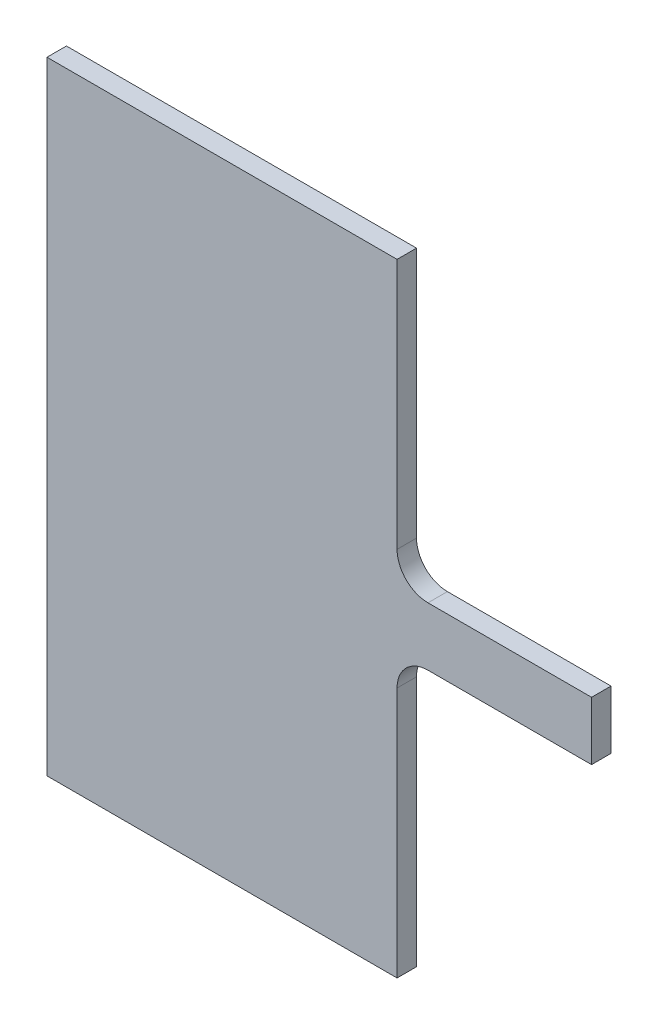
ISO-10303-21;
HEADER;
FILE_DESCRIPTION(('STEP AP214'),'2;1');
FILE_NAME('part.step','',(''),(''),'','','');
FILE_SCHEMA(('AUTOMOTIVE_DESIGN { 1 0 10303 214 1 1 1 1 }'));
ENDSEC;
DATA;
#1=APPLICATION_CONTEXT('core data for automotive mechanical design processes');
#2=APPLICATION_PROTOCOL_DEFINITION('international standard','automotive_design',2000,#1);
#3=PRODUCT_CONTEXT('',#1,'mechanical');
#4=PRODUCT('Part','Part','',(#3));
#5=PRODUCT_RELATED_PRODUCT_CATEGORY('part','',(#4));
#6=PRODUCT_DEFINITION_FORMATION('','',#4);
#7=PRODUCT_DEFINITION_CONTEXT('part definition',#1,'design');
#8=PRODUCT_DEFINITION('design','',#6,#7);
#9=PRODUCT_DEFINITION_SHAPE('','',#8);
#10=(LENGTH_UNIT() NAMED_UNIT(*) SI_UNIT(.MILLI.,.METRE.));
#11=(NAMED_UNIT(*) PLANE_ANGLE_UNIT() SI_UNIT($,.RADIAN.));
#12=(NAMED_UNIT(*) SI_UNIT($,.STERADIAN.) SOLID_ANGLE_UNIT());
#13=UNCERTAINTY_MEASURE_WITH_UNIT(LENGTH_MEASURE(1.E-05),#10,'distance_accuracy_value','');
#14=(GEOMETRIC_REPRESENTATION_CONTEXT(3) GLOBAL_UNCERTAINTY_ASSIGNED_CONTEXT((#13)) GLOBAL_UNIT_ASSIGNED_CONTEXT((#10,
#11,#12)) REPRESENTATION_CONTEXT('',''));
#15=CARTESIAN_POINT('',(0.,0.,0.));
#16=DIRECTION('',(0.,0.,1.));
#17=DIRECTION('',(1.,0.,0.));
#18=AXIS2_PLACEMENT_3D('',#15,#16,#17);
#19=CARTESIAN_POINT('',(11.7362926460684,-7.00000000000002,1.));
#20=DIRECTION('',(1.,0.,0.));
#21=DIRECTION('',(0.,0.,-1.));
#22=AXIS2_PLACEMENT_3D('',#19,#20,#21);
#23=PLANE('',#22);
#24=DIRECTION('',(0.,-1.,0.));
#25=VECTOR('',#24,1.);
#26=CARTESIAN_POINT('',(11.7362926460684,-7.00000000000002,0.));
#27=LINE('',#26,#25);
#28=CARTESIAN_POINT('',(11.7362926460684,25.,0.));
#29=VERTEX_POINT('',#28);
#30=CARTESIAN_POINT('',(11.7362926460684,-7.00000000000002,0.));
#31=VERTEX_POINT('',#30);
#32=EDGE_CURVE('E153',#29,#31,#27,.T.);
#33=ORIENTED_EDGE('',*,*,#32,.T.);
#34=DIRECTION('',(0.,0.,-1.));
#35=VECTOR('',#34,1.);
#36=CARTESIAN_POINT('',(11.7362926460684,-7.00000000000002,1.));
#37=LINE('',#36,#35);
#38=CARTESIAN_POINT('',(11.7362926460684,-7.00000000000002,1.));
#39=VERTEX_POINT('',#38);
#40=EDGE_CURVE('E11',#39,#31,#37,.T.);
#41=ORIENTED_EDGE('',*,*,#40,.F.);
#42=DIRECTION('',(0.,-1.,0.));
#43=VECTOR('',#42,1.);
#44=CARTESIAN_POINT('',(11.7362926460684,-7.00000000000002,1.));
#45=LINE('',#44,#43);
#46=CARTESIAN_POINT('',(11.7362926460684,25.,1.));
#47=VERTEX_POINT('',#46);
#48=EDGE_CURVE('E180',#47,#39,#45,.T.);
#49=ORIENTED_EDGE('',*,*,#48,.F.);
#50=DIRECTION('',(0.,0.,-1.));
#51=VECTOR('',#50,1.);
#52=CARTESIAN_POINT('',(11.7362926460684,25.,1.));
#53=LINE('',#52,#51);
#54=EDGE_CURVE('E149',#47,#29,#53,.T.);
#55=ORIENTED_EDGE('',*,*,#54,.T.);
#56=EDGE_LOOP('',(#33,#41,#49,#55));
#57=FACE_BOUND('',#56,.T.);
#58=ADVANCED_FACE('F38',(#57),#23,.F.);
#59=CARTESIAN_POINT('',(29.7362926460684,-7.00000000000002,1.));
#60=DIRECTION('',(0.,1.,0.));
#61=DIRECTION('',(-1.,0.,0.));
#62=AXIS2_PLACEMENT_3D('',#59,#60,#61);
#63=PLANE('',#62);
#64=DIRECTION('',(1.,0.,0.));
#65=VECTOR('',#64,1.);
#66=CARTESIAN_POINT('',(29.7362926460684,-7.00000000000002,0.));
#67=LINE('',#66,#65);
#68=CARTESIAN_POINT('',(29.7362926460684,-7.00000000000002,0.));
#69=VERTEX_POINT('',#68);
#70=EDGE_CURVE('E157',#31,#69,#67,.T.);
#71=ORIENTED_EDGE('',*,*,#70,.T.);
#72=DIRECTION('',(0.,0.,-1.));
#73=VECTOR('',#72,1.);
#74=CARTESIAN_POINT('',(29.7362926460684,-7.00000000000002,1.));
#75=LINE('',#74,#73);
#76=CARTESIAN_POINT('',(29.7362926460684,-7.00000000000002,1.));
#77=VERTEX_POINT('',#76);
#78=EDGE_CURVE('E47',#77,#69,#75,.T.);
#79=ORIENTED_EDGE('',*,*,#78,.F.);
#80=DIRECTION('',(1.,0.,0.));
#81=VECTOR('',#80,1.);
#82=CARTESIAN_POINT('',(29.7362926460684,-7.00000000000002,1.));
#83=LINE('',#82,#81);
#84=EDGE_CURVE('E104',#39,#77,#83,.T.);
#85=ORIENTED_EDGE('',*,*,#84,.F.);
#86=ORIENTED_EDGE('',*,*,#40,.T.);
#87=EDGE_LOOP('',(#71,#79,#85,#86));
#88=FACE_BOUND('',#87,.T.);
#89=ADVANCED_FACE('F243',(#88),#63,.F.);
#90=CARTESIAN_POINT('',(29.7362926460684,-7.00000000000002,1.));
#91=DIRECTION('',(-1.,0.,0.));
#92=DIRECTION('',(0.,0.,1.));
#93=AXIS2_PLACEMENT_3D('',#90,#91,#92);
#94=PLANE('',#93);
#95=DIRECTION('',(0.,1.,0.));
#96=VECTOR('',#95,1.);
#97=CARTESIAN_POINT('',(29.7362926460684,-7.00000000000002,0.));
#98=LINE('',#97,#96);
#99=CARTESIAN_POINT('',(29.7362926460684,5.91249999999997,0.));
#100=VERTEX_POINT('',#99);
#101=EDGE_CURVE('E160',#69,#100,#98,.T.);
#102=ORIENTED_EDGE('',*,*,#101,.T.);
#103=DIRECTION('',(0.,0.,-1.));
#104=VECTOR('',#103,1.);
#105=CARTESIAN_POINT('',(29.7362926460684,5.91249999999997,1.));
#106=LINE('',#105,#104);
#107=CARTESIAN_POINT('',(29.7362926460684,5.91249999999997,1.));
#108=VERTEX_POINT('',#107);
#109=EDGE_CURVE('E199',#108,#100,#106,.T.);
#110=ORIENTED_EDGE('',*,*,#109,.F.);
#111=DIRECTION('',(0.,1.,0.));
#112=VECTOR('',#111,1.);
#113=CARTESIAN_POINT('',(29.7362926460684,-7.00000000000002,1.));
#114=LINE('',#113,#112);
#115=EDGE_CURVE('E209',#77,#108,#114,.T.);
#116=ORIENTED_EDGE('',*,*,#115,.F.);
#117=ORIENTED_EDGE('',*,*,#78,.T.);
#118=EDGE_LOOP('',(#102,#110,#116,#117));
#119=FACE_BOUND('',#118,.T.);
#120=ADVANCED_FACE('F207',(#119),#94,.F.);
#121=CARTESIAN_POINT('',(31.3237926460684,5.91249999999998,1.));
#122=DIRECTION('',(0.,0.,-1.));
#123=DIRECTION('',(-1.,0.,0.));
#124=AXIS2_PLACEMENT_3D('',#121,#122,#123);
#125=CYLINDRICAL_SURFACE('',#124,1.5875);
#126=CARTESIAN_POINT('',(31.3237926460684,5.91249999999998,0.));
#127=DIRECTION('',(0.,0.,-1.));
#128=DIRECTION('',(1.,0.,0.));
#129=AXIS2_PLACEMENT_3D('',#126,#127,#128);
#130=CIRCLE('',#129,1.5875);
#131=CARTESIAN_POINT('',(31.3237926460684,7.49999999999998,0.));
#132=VERTEX_POINT('',#131);
#133=EDGE_CURVE('E163',#100,#132,#130,.T.);
#134=ORIENTED_EDGE('',*,*,#133,.T.);
#135=DIRECTION('',(0.,0.,-1.));
#136=VECTOR('',#135,1.);
#137=CARTESIAN_POINT('',(31.3237926460684,7.49999999999998,1.));
#138=LINE('',#137,#136);
#139=CARTESIAN_POINT('',(31.3237926460684,7.49999999999998,1.));
#140=VERTEX_POINT('',#139);
#141=EDGE_CURVE('E195',#140,#132,#138,.T.);
#142=ORIENTED_EDGE('',*,*,#141,.F.);
#143=CARTESIAN_POINT('',(31.3237926460684,5.91249999999998,1.));
#144=DIRECTION('',(0.,0.,-1.));
#145=DIRECTION('',(1.,0.,0.));
#146=AXIS2_PLACEMENT_3D('',#143,#144,#145);
#147=CIRCLE('',#146,1.5875);
#148=EDGE_CURVE('E228',#108,#140,#147,.T.);
#149=ORIENTED_EDGE('',*,*,#148,.F.);
#150=ORIENTED_EDGE('',*,*,#109,.T.);
#151=EDGE_LOOP('',(#134,#142,#149,#150));
#152=FACE_BOUND('',#151,.T.);
#153=ADVANCED_FACE('F218',(#152),#125,.F.);
#154=CARTESIAN_POINT('',(31.3237926460684,7.49999999999998,1.));
#155=DIRECTION('',(0.,1.,0.));
#156=DIRECTION('',(0.,0.,1.));
#157=AXIS2_PLACEMENT_3D('',#154,#155,#156);
#158=PLANE('',#157);
#159=DIRECTION('',(1.,0.,0.));
#160=VECTOR('',#159,1.);
#161=CARTESIAN_POINT('',(31.3237926460684,7.49999999999998,0.));
#162=LINE('',#161,#160);
#163=CARTESIAN_POINT('',(39.7362926460684,7.49999999999998,0.));
#164=VERTEX_POINT('',#163);
#165=EDGE_CURVE('E166',#132,#164,#162,.T.);
#166=ORIENTED_EDGE('',*,*,#165,.T.);
#167=DIRECTION('',(0.,0.,-1.));
#168=VECTOR('',#167,1.);
#169=CARTESIAN_POINT('',(39.7362926460684,7.49999999999998,1.));
#170=LINE('',#169,#168);
#171=CARTESIAN_POINT('',(39.7362926460684,7.49999999999998,1.));
#172=VERTEX_POINT('',#171);
#173=EDGE_CURVE('E191',#172,#164,#170,.T.);
#174=ORIENTED_EDGE('',*,*,#173,.F.);
#175=DIRECTION('',(1.,0.,0.));
#176=VECTOR('',#175,1.);
#177=CARTESIAN_POINT('',(31.3237926460684,7.49999999999998,1.));
#178=LINE('',#177,#176);
#179=EDGE_CURVE('E224',#140,#172,#178,.T.);
#180=ORIENTED_EDGE('',*,*,#179,.F.);
#181=ORIENTED_EDGE('',*,*,#141,.T.);
#182=EDGE_LOOP('',(#166,#174,#180,#181));
#183=FACE_BOUND('',#182,.T.);
#184=ADVANCED_FACE('F222',(#183),#158,.F.);
#185=CARTESIAN_POINT('',(39.7362926460684,7.49999999999998,1.));
#186=DIRECTION('',(-1.,0.,0.));
#187=DIRECTION('',(0.,0.,1.));
#188=AXIS2_PLACEMENT_3D('',#185,#186,#187);
#189=PLANE('',#188);
#190=DIRECTION('',(0.,1.,0.));
#191=VECTOR('',#190,1.);
#192=CARTESIAN_POINT('',(39.7362926460684,7.49999999999998,0.));
#193=LINE('',#192,#191);
#194=CARTESIAN_POINT('',(39.7362926460684,10.5,0.));
#195=VERTEX_POINT('',#194);
#196=EDGE_CURVE('E168',#164,#195,#193,.T.);
#197=ORIENTED_EDGE('',*,*,#196,.T.);
#198=DIRECTION('',(0.,0.,-1.));
#199=VECTOR('',#198,1.);
#200=CARTESIAN_POINT('',(39.7362926460684,10.5,1.));
#201=LINE('',#200,#199);
#202=CARTESIAN_POINT('',(39.7362926460684,10.5,1.));
#203=VERTEX_POINT('',#202);
#204=EDGE_CURVE('E187',#203,#195,#201,.T.);
#205=ORIENTED_EDGE('',*,*,#204,.F.);
#206=DIRECTION('',(0.,1.,0.));
#207=VECTOR('',#206,1.);
#208=CARTESIAN_POINT('',(39.7362926460684,7.49999999999998,1.));
#209=LINE('',#208,#207);
#210=EDGE_CURVE('E227',#172,#203,#209,.T.);
#211=ORIENTED_EDGE('',*,*,#210,.F.);
#212=ORIENTED_EDGE('',*,*,#173,.T.);
#213=EDGE_LOOP('',(#197,#205,#211,#212));
#214=FACE_BOUND('',#213,.T.);
#215=ADVANCED_FACE('F255',(#214),#189,.F.);
#216=CARTESIAN_POINT('',(39.7362926460684,10.5,1.));
#217=DIRECTION('',(0.,-1.,0.));
#218=DIRECTION('',(1.,0.,0.));
#219=AXIS2_PLACEMENT_3D('',#216,#217,#218);
#220=PLANE('',#219);
#221=DIRECTION('',(-1.,0.,0.));
#222=VECTOR('',#221,1.);
#223=CARTESIAN_POINT('',(39.7362926460684,10.5,0.));
#224=LINE('',#223,#222);
#225=CARTESIAN_POINT('',(31.3237926460684,10.5,0.));
#226=VERTEX_POINT('',#225);
#227=EDGE_CURVE('E171',#195,#226,#224,.T.);
#228=ORIENTED_EDGE('',*,*,#227,.T.);
#229=DIRECTION('',(0.,0.,-1.));
#230=VECTOR('',#229,1.);
#231=CARTESIAN_POINT('',(31.3237926460684,10.5,1.));
#232=LINE('',#231,#230);
#233=CARTESIAN_POINT('',(31.3237926460684,10.5,1.));
#234=VERTEX_POINT('',#233);
#235=EDGE_CURVE('E140',#234,#226,#232,.T.);
#236=ORIENTED_EDGE('',*,*,#235,.F.);
#237=DIRECTION('',(-1.,0.,0.));
#238=VECTOR('',#237,1.);
#239=CARTESIAN_POINT('',(39.7362926460684,10.5,1.));
#240=LINE('',#239,#238);
#241=EDGE_CURVE('E129',#203,#234,#240,.T.);
#242=ORIENTED_EDGE('',*,*,#241,.F.);
#243=ORIENTED_EDGE('',*,*,#204,.T.);
#244=EDGE_LOOP('',(#228,#236,#242,#243));
#245=FACE_BOUND('',#244,.T.);
#246=ADVANCED_FACE('F258',(#245),#220,.F.);
#247=CARTESIAN_POINT('',(31.3237926460684,12.0875,1.));
#248=DIRECTION('',(0.,0.,-1.));
#249=DIRECTION('',(-1.,0.,0.));
#250=AXIS2_PLACEMENT_3D('',#247,#248,#249);
#251=CYLINDRICAL_SURFACE('',#250,1.5875);
#252=CARTESIAN_POINT('',(31.3237926460684,12.0875,0.));
#253=DIRECTION('',(0.,0.,-1.));
#254=DIRECTION('',(-1.,0.,0.));
#255=AXIS2_PLACEMENT_3D('',#252,#253,#254);
#256=CIRCLE('',#255,1.5875);
#257=CARTESIAN_POINT('',(29.7362926460684,12.0875,0.));
#258=VERTEX_POINT('',#257);
#259=EDGE_CURVE('E138',#226,#258,#256,.T.);
#260=ORIENTED_EDGE('',*,*,#259,.T.);
#261=DIRECTION('',(0.,0.,-1.));
#262=VECTOR('',#261,1.);
#263=CARTESIAN_POINT('',(29.7362926460684,12.0875,1.));
#264=LINE('',#263,#262);
#265=CARTESIAN_POINT('',(29.7362926460684,12.0875,1.));
#266=VERTEX_POINT('',#265);
#267=EDGE_CURVE('E135',#266,#258,#264,.T.);
#268=ORIENTED_EDGE('',*,*,#267,.F.);
#269=CARTESIAN_POINT('',(31.3237926460684,12.0875,1.));
#270=DIRECTION('',(0.,0.,-1.));
#271=DIRECTION('',(-1.,0.,0.));
#272=AXIS2_PLACEMENT_3D('',#269,#270,#271);
#273=CIRCLE('',#272,1.5875);
#274=EDGE_CURVE('E123',#234,#266,#273,.T.);
#275=ORIENTED_EDGE('',*,*,#274,.F.);
#276=ORIENTED_EDGE('',*,*,#235,.T.);
#277=EDGE_LOOP('',(#260,#268,#275,#276));
#278=FACE_BOUND('',#277,.T.);
#279=ADVANCED_FACE('F136',(#278),#251,.F.);
#280=CARTESIAN_POINT('',(29.7362926460684,12.0875,1.));
#281=DIRECTION('',(-1.,0.,0.));
#282=DIRECTION('',(0.,-1.,0.));
#283=AXIS2_PLACEMENT_3D('',#280,#281,#282);
#284=PLANE('',#283);
#285=DIRECTION('',(0.,1.,0.));
#286=VECTOR('',#285,1.);
#287=CARTESIAN_POINT('',(29.7362926460684,12.0875,0.));
#288=LINE('',#287,#286);
#289=CARTESIAN_POINT('',(29.7362926460684,25.,0.));
#290=VERTEX_POINT('',#289);
#291=EDGE_CURVE('E90',#258,#290,#288,.T.);
#292=ORIENTED_EDGE('',*,*,#291,.T.);
#293=DIRECTION('',(0.,0.,-1.));
#294=VECTOR('',#293,1.);
#295=CARTESIAN_POINT('',(29.7362926460684,25.,1.));
#296=LINE('',#295,#294);
#297=CARTESIAN_POINT('',(29.7362926460684,25.,1.));
#298=VERTEX_POINT('',#297);
#299=EDGE_CURVE('E141',#298,#290,#296,.T.);
#300=ORIENTED_EDGE('',*,*,#299,.F.);
#301=DIRECTION('',(0.,1.,0.));
#302=VECTOR('',#301,1.);
#303=CARTESIAN_POINT('',(29.7362926460684,12.0875,1.));
#304=LINE('',#303,#302);
#305=EDGE_CURVE('E127',#266,#298,#304,.T.);
#306=ORIENTED_EDGE('',*,*,#305,.F.);
#307=ORIENTED_EDGE('',*,*,#267,.T.);
#308=EDGE_LOOP('',(#292,#300,#306,#307));
#309=FACE_BOUND('',#308,.T.);
#310=ADVANCED_FACE('F143',(#309),#284,.F.);
#311=CARTESIAN_POINT('',(11.7362926460684,25.,1.));
#312=DIRECTION('',(0.,-1.,0.));
#313=DIRECTION('',(0.,0.,-1.));
#314=AXIS2_PLACEMENT_3D('',#311,#312,#313);
#315=PLANE('',#314);
#316=DIRECTION('',(-1.,0.,0.));
#317=VECTOR('',#316,1.);
#318=CARTESIAN_POINT('',(11.7362926460684,25.,0.));
#319=LINE('',#318,#317);
#320=EDGE_CURVE('E96',#290,#29,#319,.T.);
#321=ORIENTED_EDGE('',*,*,#320,.T.);
#322=ORIENTED_EDGE('',*,*,#54,.F.);
#323=DIRECTION('',(-1.,0.,0.));
#324=VECTOR('',#323,1.);
#325=CARTESIAN_POINT('',(11.7362926460684,25.,1.));
#326=LINE('',#325,#324);
#327=EDGE_CURVE('E55',#298,#47,#326,.T.);
#328=ORIENTED_EDGE('',*,*,#327,.F.);
#329=ORIENTED_EDGE('',*,*,#299,.T.);
#330=EDGE_LOOP('',(#321,#322,#328,#329));
#331=FACE_BOUND('',#330,.T.);
#332=ADVANCED_FACE('F267',(#331),#315,.F.);
#333=CARTESIAN_POINT('',(31.3237926460684,12.0875,1.));
#334=DIRECTION('',(0.,0.,-1.));
#335=DIRECTION('',(-1.,0.,0.));
#336=AXIS2_PLACEMENT_3D('',#333,#334,#335);
#337=PLANE('',#336);
#338=ORIENTED_EDGE('',*,*,#48,.T.);
#339=ORIENTED_EDGE('',*,*,#84,.T.);
#340=ORIENTED_EDGE('',*,*,#115,.T.);
#341=ORIENTED_EDGE('',*,*,#148,.T.);
#342=ORIENTED_EDGE('',*,*,#179,.T.);
#343=ORIENTED_EDGE('',*,*,#210,.T.);
#344=ORIENTED_EDGE('',*,*,#241,.T.);
#345=ORIENTED_EDGE('',*,*,#274,.T.);
#346=ORIENTED_EDGE('',*,*,#305,.T.);
#347=ORIENTED_EDGE('',*,*,#327,.T.);
#348=EDGE_LOOP('',(#338,#339,#340,#341,#342,#343,#344,#345,#346,#347));
#349=FACE_BOUND('',#348,.T.);
#350=ADVANCED_FACE('F125',(#349),#337,.F.);
#351=CARTESIAN_POINT('',(31.3237926460684,12.0875,0.));
#352=DIRECTION('',(0.,0.,-1.));
#353=DIRECTION('',(-1.,0.,0.));
#354=AXIS2_PLACEMENT_3D('',#351,#352,#353);
#355=PLANE('',#354);
#356=ORIENTED_EDGE('',*,*,#32,.F.);
#357=ORIENTED_EDGE('',*,*,#320,.F.);
#358=ORIENTED_EDGE('',*,*,#291,.F.);
#359=ORIENTED_EDGE('',*,*,#259,.F.);
#360=ORIENTED_EDGE('',*,*,#227,.F.);
#361=ORIENTED_EDGE('',*,*,#196,.F.);
#362=ORIENTED_EDGE('',*,*,#165,.F.);
#363=ORIENTED_EDGE('',*,*,#133,.F.);
#364=ORIENTED_EDGE('',*,*,#101,.F.);
#365=ORIENTED_EDGE('',*,*,#70,.F.);
#366=EDGE_LOOP('',(#356,#357,#358,#359,#360,#361,#362,#363,#364,#365));
#367=FACE_BOUND('',#366,.T.);
#368=ADVANCED_FACE('F213',(#367),#355,.T.);
#369=CLOSED_SHELL('',(#58,#89,#120,#153,#184,#215,#246,#279,#310,#332,#350,#368));
#370=MANIFOLD_SOLID_BREP('B2',#369);
#371=ADVANCED_BREP_SHAPE_REPRESENTATION('',(#18,#370),#14);
#372=SHAPE_DEFINITION_REPRESENTATION(#9,#371);
ENDSEC;
END-ISO-10303-21;
